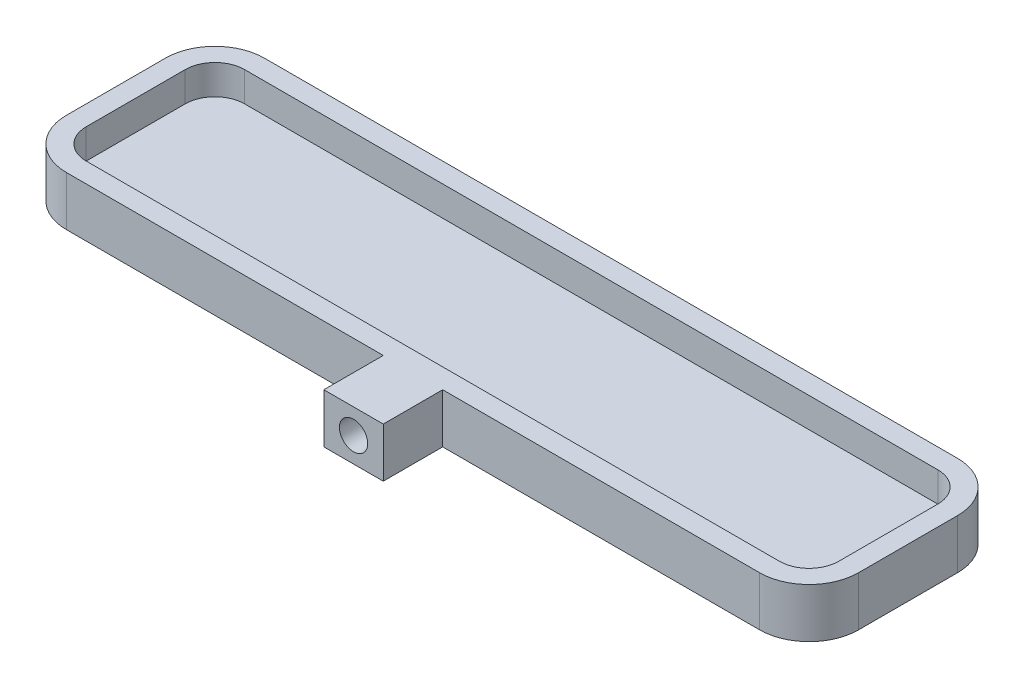
ISO-10303-21;
HEADER;
FILE_DESCRIPTION(('STEP AP214'),'2;1');
FILE_NAME('part.step','',(''),(''),'','','');
FILE_SCHEMA(('AUTOMOTIVE_DESIGN { 1 0 10303 214 1 1 1 1 }'));
ENDSEC;
DATA;
#1=APPLICATION_CONTEXT('core data for automotive mechanical design processes');
#2=APPLICATION_PROTOCOL_DEFINITION('international standard','automotive_design',2000,#1);
#3=PRODUCT_CONTEXT('',#1,'mechanical');
#4=PRODUCT('Part','Part','',(#3));
#5=PRODUCT_RELATED_PRODUCT_CATEGORY('part','',(#4));
#6=PRODUCT_DEFINITION_FORMATION('','',#4);
#7=PRODUCT_DEFINITION_CONTEXT('part definition',#1,'design');
#8=PRODUCT_DEFINITION('design','',#6,#7);
#9=PRODUCT_DEFINITION_SHAPE('','',#8);
#10=(LENGTH_UNIT() NAMED_UNIT(*) SI_UNIT(.MILLI.,.METRE.));
#11=(NAMED_UNIT(*) PLANE_ANGLE_UNIT() SI_UNIT($,.RADIAN.));
#12=(NAMED_UNIT(*) SI_UNIT($,.STERADIAN.) SOLID_ANGLE_UNIT());
#13=UNCERTAINTY_MEASURE_WITH_UNIT(LENGTH_MEASURE(1.E-05),#10,'distance_accuracy_value','');
#14=(GEOMETRIC_REPRESENTATION_CONTEXT(3) GLOBAL_UNCERTAINTY_ASSIGNED_CONTEXT((#13)) GLOBAL_UNIT_ASSIGNED_CONTEXT((#10,
#11,#12)) REPRESENTATION_CONTEXT('',''));
#15=CARTESIAN_POINT('',(0.,0.,0.));
#16=DIRECTION('',(0.,0.,1.));
#17=DIRECTION('',(1.,0.,0.));
#18=AXIS2_PLACEMENT_3D('',#15,#16,#17);
#19=CARTESIAN_POINT('',(-40.,5.,10.));
#20=DIRECTION('',(0.,0.,-1.));
#21=DIRECTION('',(-1.,0.,0.));
#22=AXIS2_PLACEMENT_3D('',#19,#20,#21);
#23=PLANE('',#22);
#24=DIRECTION('',(0.,1.,0.));
#25=VECTOR('',#24,1.);
#26=CARTESIAN_POINT('',(3.,5.,10.));
#27=LINE('',#26,#25);
#28=CARTESIAN_POINT('',(3.,0.,10.));
#29=VERTEX_POINT('',#28);
#30=CARTESIAN_POINT('',(3.,5.,10.));
#31=VERTEX_POINT('',#30);
#32=EDGE_CURVE('E198',#29,#31,#27,.T.);
#33=ORIENTED_EDGE('',*,*,#32,.F.);
#34=DIRECTION('',(1.,0.,0.));
#35=VECTOR('',#34,1.);
#36=CARTESIAN_POINT('',(-40.,0.,10.));
#37=LINE('',#36,#35);
#38=CARTESIAN_POINT('',(35.,0.,10.));
#39=VERTEX_POINT('',#38);
#40=EDGE_CURVE('E280',#29,#39,#37,.T.);
#41=ORIENTED_EDGE('',*,*,#40,.T.);
#42=DIRECTION('',(0.,-1.,0.));
#43=VECTOR('',#42,1.);
#44=CARTESIAN_POINT('',(35.,5.,10.));
#45=LINE('',#44,#43);
#46=CARTESIAN_POINT('',(35.,5.,10.));
#47=VERTEX_POINT('',#46);
#48=EDGE_CURVE('E317',#39,#47,#45,.F.);
#49=ORIENTED_EDGE('',*,*,#48,.T.);
#50=DIRECTION('',(1.,0.,0.));
#51=VECTOR('',#50,1.);
#52=CARTESIAN_POINT('',(-40.,5.,10.));
#53=LINE('',#52,#51);
#54=EDGE_CURVE('E52',#31,#47,#53,.T.);
#55=ORIENTED_EDGE('',*,*,#54,.F.);
#56=EDGE_LOOP('',(#33,#41,#49,#55));
#57=FACE_BOUND('',#56,.T.);
#58=ADVANCED_FACE('F37',(#57),#23,.F.);
#59=DIRECTION('',(0.,-1.,0.));
#60=VECTOR('',#59,1.);
#61=CARTESIAN_POINT('',(-3.,5.,10.));
#62=LINE('',#61,#60);
#63=CARTESIAN_POINT('',(-3.,5.,10.));
#64=VERTEX_POINT('',#63);
#65=CARTESIAN_POINT('',(-3.,0.,10.));
#66=VERTEX_POINT('',#65);
#67=EDGE_CURVE('E60',#64,#66,#62,.T.);
#68=ORIENTED_EDGE('',*,*,#67,.F.);
#69=CARTESIAN_POINT('',(-35.,5.,10.));
#70=VERTEX_POINT('',#69);
#71=EDGE_CURVE('E269',#70,#64,#53,.T.);
#72=ORIENTED_EDGE('',*,*,#71,.F.);
#73=DIRECTION('',(0.,-1.,0.));
#74=VECTOR('',#73,1.);
#75=CARTESIAN_POINT('',(-35.,5.,10.));
#76=LINE('',#75,#74);
#77=CARTESIAN_POINT('',(-35.,0.,10.));
#78=VERTEX_POINT('',#77);
#79=EDGE_CURVE('E314',#70,#78,#76,.T.);
#80=ORIENTED_EDGE('',*,*,#79,.T.);
#81=EDGE_CURVE('E281',#78,#66,#37,.T.);
#82=ORIENTED_EDGE('',*,*,#81,.T.);
#83=EDGE_LOOP('',(#68,#72,#80,#82));
#84=FACE_BOUND('',#83,.T.);
#85=ADVANCED_FACE('F336',(#84),#23,.F.);
#86=CARTESIAN_POINT('',(0.,5.,0.));
#87=DIRECTION('',(0.,1.,0.));
#88=DIRECTION('',(0.,0.,1.));
#89=AXIS2_PLACEMENT_3D('',#86,#87,#88);
#90=PLANE('',#89);
#91=DIRECTION('',(0.,0.,1.));
#92=VECTOR('',#91,1.);
#93=CARTESIAN_POINT('',(40.,5.,-10.));
#94=LINE('',#93,#92);
#95=CARTESIAN_POINT('',(40.,5.,-5.));
#96=VERTEX_POINT('',#95);
#97=CARTESIAN_POINT('',(40.,5.,5.));
#98=VERTEX_POINT('',#97);
#99=EDGE_CURVE('E271',#96,#98,#94,.T.);
#100=ORIENTED_EDGE('',*,*,#99,.F.);
#101=CARTESIAN_POINT('',(35.,5.,-5.));
#102=DIRECTION('',(0.,1.,0.));
#103=DIRECTION('',(0.,0.,1.));
#104=AXIS2_PLACEMENT_3D('',#101,#102,#103);
#105=CIRCLE('',#104,5.);
#106=CARTESIAN_POINT('',(35.,5.,-10.));
#107=VERTEX_POINT('',#106);
#108=EDGE_CURVE('E312',#96,#107,#105,.T.);
#109=ORIENTED_EDGE('',*,*,#108,.T.);
#110=DIRECTION('',(1.,0.,0.));
#111=VECTOR('',#110,1.);
#112=CARTESIAN_POINT('',(-40.,5.,-10.));
#113=LINE('',#112,#111);
#114=CARTESIAN_POINT('',(-35.,5.,-10.));
#115=VERTEX_POINT('',#114);
#116=EDGE_CURVE('E274',#115,#107,#113,.T.);
#117=ORIENTED_EDGE('',*,*,#116,.F.);
#118=CARTESIAN_POINT('',(-35.,5.,-5.));
#119=DIRECTION('',(0.,1.,0.));
#120=DIRECTION('',(0.,0.,1.));
#121=AXIS2_PLACEMENT_3D('',#118,#119,#120);
#122=CIRCLE('',#121,5.);
#123=CARTESIAN_POINT('',(-40.,5.,-5.));
#124=VERTEX_POINT('',#123);
#125=EDGE_CURVE('E306',#115,#124,#122,.T.);
#126=ORIENTED_EDGE('',*,*,#125,.T.);
#127=DIRECTION('',(0.,0.,1.));
#128=VECTOR('',#127,1.);
#129=CARTESIAN_POINT('',(-40.,5.,-10.));
#130=LINE('',#129,#128);
#131=CARTESIAN_POINT('',(-40.,5.,5.));
#132=VERTEX_POINT('',#131);
#133=EDGE_CURVE('E265',#124,#132,#130,.T.);
#134=ORIENTED_EDGE('',*,*,#133,.T.);
#135=CARTESIAN_POINT('',(-35.,5.,5.));
#136=DIRECTION('',(0.,1.,0.));
#137=DIRECTION('',(0.,0.,1.));
#138=AXIS2_PLACEMENT_3D('',#135,#136,#137);
#139=CIRCLE('',#138,5.);
#140=EDGE_CURVE('E308',#132,#70,#139,.T.);
#141=ORIENTED_EDGE('',*,*,#140,.T.);
#142=ORIENTED_EDGE('',*,*,#71,.T.);
#143=DIRECTION('',(0.,0.,-1.));
#144=VECTOR('',#143,1.);
#145=CARTESIAN_POINT('',(-3.,5.,16.));
#146=LINE('',#145,#144);
#147=CARTESIAN_POINT('',(-3.,5.,16.));
#148=VERTEX_POINT('',#147);
#149=EDGE_CURVE('E183',#148,#64,#146,.T.);
#150=ORIENTED_EDGE('',*,*,#149,.F.);
#151=DIRECTION('',(-1.,0.,0.));
#152=VECTOR('',#151,1.);
#153=CARTESIAN_POINT('',(-3.,5.,16.));
#154=LINE('',#153,#152);
#155=CARTESIAN_POINT('',(3.,5.,16.));
#156=VERTEX_POINT('',#155);
#157=EDGE_CURVE('E174',#156,#148,#154,.T.);
#158=ORIENTED_EDGE('',*,*,#157,.F.);
#159=DIRECTION('',(0.,0.,-1.));
#160=VECTOR('',#159,1.);
#161=CARTESIAN_POINT('',(3.,5.,16.));
#162=LINE('',#161,#160);
#163=EDGE_CURVE('E180',#156,#31,#162,.T.);
#164=ORIENTED_EDGE('',*,*,#163,.T.);
#165=ORIENTED_EDGE('',*,*,#54,.T.);
#166=CARTESIAN_POINT('',(35.,5.,5.));
#167=DIRECTION('',(0.,1.,0.));
#168=DIRECTION('',(0.,0.,1.));
#169=AXIS2_PLACEMENT_3D('',#166,#167,#168);
#170=CIRCLE('',#169,5.);
#171=EDGE_CURVE('E310',#47,#98,#170,.T.);
#172=ORIENTED_EDGE('',*,*,#171,.T.);
#173=EDGE_LOOP('',(#100,#109,#117,#126,#134,#141,#142,#150,#158,#164,#165,#172));
#174=FACE_BOUND('',#173,.T.);
#175=CARTESIAN_POINT('',(35.,5.,-5.));
#176=DIRECTION('',(0.,1.,0.));
#177=DIRECTION('',(0.,0.,1.));
#178=AXIS2_PLACEMENT_3D('',#175,#176,#177);
#179=CIRCLE('',#178,3.);
#180=CARTESIAN_POINT('',(38.,5.,-5.));
#181=VERTEX_POINT('',#180);
#182=CARTESIAN_POINT('',(35.,5.,-8.));
#183=VERTEX_POINT('',#182);
#184=EDGE_CURVE('E239',#181,#183,#179,.T.);
#185=ORIENTED_EDGE('',*,*,#184,.F.);
#186=DIRECTION('',(0.,0.,1.));
#187=VECTOR('',#186,1.);
#188=CARTESIAN_POINT('',(38.,5.,-10.));
#189=LINE('',#188,#187);
#190=CARTESIAN_POINT('',(38.,5.,5.));
#191=VERTEX_POINT('',#190);
#192=EDGE_CURVE('E257',#181,#191,#189,.T.);
#193=ORIENTED_EDGE('',*,*,#192,.T.);
#194=CARTESIAN_POINT('',(35.,5.,5.));
#195=DIRECTION('',(0.,1.,0.));
#196=DIRECTION('',(0.,0.,1.));
#197=AXIS2_PLACEMENT_3D('',#194,#195,#196);
#198=CIRCLE('',#197,3.);
#199=CARTESIAN_POINT('',(35.,5.,8.));
#200=VERTEX_POINT('',#199);
#201=EDGE_CURVE('E255',#200,#191,#198,.T.);
#202=ORIENTED_EDGE('',*,*,#201,.F.);
#203=DIRECTION('',(1.,0.,0.));
#204=VECTOR('',#203,1.);
#205=CARTESIAN_POINT('',(-40.,5.,8.));
#206=LINE('',#205,#204);
#207=CARTESIAN_POINT('',(-35.,5.,8.));
#208=VERTEX_POINT('',#207);
#209=EDGE_CURVE('E252',#208,#200,#206,.T.);
#210=ORIENTED_EDGE('',*,*,#209,.F.);
#211=CARTESIAN_POINT('',(-35.,5.,5.));
#212=DIRECTION('',(0.,1.,0.));
#213=DIRECTION('',(0.,0.,1.));
#214=AXIS2_PLACEMENT_3D('',#211,#212,#213);
#215=CIRCLE('',#214,3.);
#216=CARTESIAN_POINT('',(-38.,5.,5.));
#217=VERTEX_POINT('',#216);
#218=EDGE_CURVE('E253',#217,#208,#215,.T.);
#219=ORIENTED_EDGE('',*,*,#218,.F.);
#220=DIRECTION('',(0.,0.,1.));
#221=VECTOR('',#220,1.);
#222=CARTESIAN_POINT('',(-38.,5.,-10.));
#223=LINE('',#222,#221);
#224=CARTESIAN_POINT('',(-38.,5.,-5.));
#225=VERTEX_POINT('',#224);
#226=EDGE_CURVE('E218',#225,#217,#223,.T.);
#227=ORIENTED_EDGE('',*,*,#226,.F.);
#228=CARTESIAN_POINT('',(-35.,5.,-5.));
#229=DIRECTION('',(0.,1.,0.));
#230=DIRECTION('',(0.,0.,1.));
#231=AXIS2_PLACEMENT_3D('',#228,#229,#230);
#232=CIRCLE('',#231,3.);
#233=CARTESIAN_POINT('',(-35.,5.,-8.));
#234=VERTEX_POINT('',#233);
#235=EDGE_CURVE('E244',#234,#225,#232,.T.);
#236=ORIENTED_EDGE('',*,*,#235,.F.);
#237=DIRECTION('',(1.,0.,0.));
#238=VECTOR('',#237,1.);
#239=CARTESIAN_POINT('',(-40.,5.,-8.));
#240=LINE('',#239,#238);
#241=EDGE_CURVE('E249',#234,#183,#240,.T.);
#242=ORIENTED_EDGE('',*,*,#241,.T.);
#243=EDGE_LOOP('',(#185,#193,#202,#210,#219,#227,#236,#242));
#244=FACE_BOUND('',#243,.T.);
#245=ADVANCED_FACE('F177',(#174,#244),#90,.T.);
#246=CARTESIAN_POINT('',(-40.,5.,-10.));
#247=DIRECTION('',(1.,0.,0.));
#248=DIRECTION('',(0.,0.,-1.));
#249=AXIS2_PLACEMENT_3D('',#246,#247,#248);
#250=PLANE('',#249);
#251=DIRECTION('',(0.,0.,1.));
#252=VECTOR('',#251,1.);
#253=CARTESIAN_POINT('',(-40.,0.,-10.));
#254=LINE('',#253,#252);
#255=CARTESIAN_POINT('',(-40.,0.,-5.));
#256=VERTEX_POINT('',#255);
#257=CARTESIAN_POINT('',(-40.,0.,5.));
#258=VERTEX_POINT('',#257);
#259=EDGE_CURVE('E210',#256,#258,#254,.T.);
#260=ORIENTED_EDGE('',*,*,#259,.T.);
#261=DIRECTION('',(0.,-1.,0.));
#262=VECTOR('',#261,1.);
#263=CARTESIAN_POINT('',(-40.,5.,5.));
#264=LINE('',#263,#262);
#265=EDGE_CURVE('E11',#258,#132,#264,.F.);
#266=ORIENTED_EDGE('',*,*,#265,.T.);
#267=ORIENTED_EDGE('',*,*,#133,.F.);
#268=DIRECTION('',(0.,-1.,0.));
#269=VECTOR('',#268,1.);
#270=CARTESIAN_POINT('',(-40.,0.,-5.));
#271=LINE('',#270,#269);
#272=EDGE_CURVE('E45',#124,#256,#271,.T.);
#273=ORIENTED_EDGE('',*,*,#272,.T.);
#274=EDGE_LOOP('',(#260,#266,#267,#273));
#275=FACE_BOUND('',#274,.T.);
#276=ADVANCED_FACE('F323',(#275),#250,.F.);
#277=CARTESIAN_POINT('',(40.,5.,-10.));
#278=DIRECTION('',(1.,0.,0.));
#279=DIRECTION('',(0.,0.,-1.));
#280=AXIS2_PLACEMENT_3D('',#277,#278,#279);
#281=PLANE('',#280);
#282=DIRECTION('',(0.,0.,1.));
#283=VECTOR('',#282,1.);
#284=CARTESIAN_POINT('',(40.,0.,-10.));
#285=LINE('',#284,#283);
#286=CARTESIAN_POINT('',(40.,0.,-5.));
#287=VERTEX_POINT('',#286);
#288=CARTESIAN_POINT('',(40.,0.,5.));
#289=VERTEX_POINT('',#288);
#290=EDGE_CURVE('E283',#287,#289,#285,.T.);
#291=ORIENTED_EDGE('',*,*,#290,.F.);
#292=DIRECTION('',(0.,-1.,0.));
#293=VECTOR('',#292,1.);
#294=CARTESIAN_POINT('',(40.,5.,-5.));
#295=LINE('',#294,#293);
#296=EDGE_CURVE('E304',#287,#96,#295,.F.);
#297=ORIENTED_EDGE('',*,*,#296,.T.);
#298=ORIENTED_EDGE('',*,*,#99,.T.);
#299=DIRECTION('',(0.,-1.,0.));
#300=VECTOR('',#299,1.);
#301=CARTESIAN_POINT('',(40.,0.,5.));
#302=LINE('',#301,#300);
#303=EDGE_CURVE('E301',#98,#289,#302,.T.);
#304=ORIENTED_EDGE('',*,*,#303,.T.);
#305=EDGE_LOOP('',(#291,#297,#298,#304));
#306=FACE_BOUND('',#305,.T.);
#307=ADVANCED_FACE('F355',(#306),#281,.T.);
#308=CARTESIAN_POINT('',(-40.,5.,-10.));
#309=DIRECTION('',(0.,0.,-1.));
#310=DIRECTION('',(-1.,0.,0.));
#311=AXIS2_PLACEMENT_3D('',#308,#309,#310);
#312=PLANE('',#311);
#313=ORIENTED_EDGE('',*,*,#116,.T.);
#314=DIRECTION('',(0.,-1.,0.));
#315=VECTOR('',#314,1.);
#316=CARTESIAN_POINT('',(35.,5.,-10.));
#317=LINE('',#316,#315);
#318=CARTESIAN_POINT('',(35.,0.,-10.));
#319=VERTEX_POINT('',#318);
#320=EDGE_CURVE('E289',#107,#319,#317,.T.);
#321=ORIENTED_EDGE('',*,*,#320,.T.);
#322=DIRECTION('',(1.,0.,0.));
#323=VECTOR('',#322,1.);
#324=CARTESIAN_POINT('',(-40.,0.,-10.));
#325=LINE('',#324,#323);
#326=CARTESIAN_POINT('',(-35.,0.,-10.));
#327=VERTEX_POINT('',#326);
#328=EDGE_CURVE('E268',#327,#319,#325,.T.);
#329=ORIENTED_EDGE('',*,*,#328,.F.);
#330=DIRECTION('',(0.,-1.,0.));
#331=VECTOR('',#330,1.);
#332=CARTESIAN_POINT('',(-35.,5.,-10.));
#333=LINE('',#332,#331);
#334=EDGE_CURVE('E277',#327,#115,#333,.F.);
#335=ORIENTED_EDGE('',*,*,#334,.T.);
#336=EDGE_LOOP('',(#313,#321,#329,#335));
#337=FACE_BOUND('',#336,.T.);
#338=ADVANCED_FACE('F382',(#337),#312,.T.);
#339=CARTESIAN_POINT('',(0.,0.,0.));
#340=DIRECTION('',(0.,1.,0.));
#341=DIRECTION('',(0.,0.,1.));
#342=AXIS2_PLACEMENT_3D('',#339,#340,#341);
#343=PLANE('',#342);
#344=ORIENTED_EDGE('',*,*,#328,.T.);
#345=CARTESIAN_POINT('',(35.,0.,-5.));
#346=DIRECTION('',(0.,1.,0.));
#347=DIRECTION('',(0.,0.,1.));
#348=AXIS2_PLACEMENT_3D('',#345,#346,#347);
#349=CIRCLE('',#348,5.);
#350=EDGE_CURVE('E299',#319,#287,#349,.F.);
#351=ORIENTED_EDGE('',*,*,#350,.T.);
#352=ORIENTED_EDGE('',*,*,#290,.T.);
#353=CARTESIAN_POINT('',(35.,0.,5.));
#354=DIRECTION('',(0.,1.,0.));
#355=DIRECTION('',(0.,0.,1.));
#356=AXIS2_PLACEMENT_3D('',#353,#354,#355);
#357=CIRCLE('',#356,5.);
#358=EDGE_CURVE('E296',#289,#39,#357,.F.);
#359=ORIENTED_EDGE('',*,*,#358,.T.);
#360=ORIENTED_EDGE('',*,*,#40,.F.);
#361=DIRECTION('',(0.,0.,-1.));
#362=VECTOR('',#361,1.);
#363=CARTESIAN_POINT('',(3.,0.,16.));
#364=LINE('',#363,#362);
#365=CARTESIAN_POINT('',(3.,0.,16.));
#366=VERTEX_POINT('',#365);
#367=EDGE_CURVE('E341',#366,#29,#364,.T.);
#368=ORIENTED_EDGE('',*,*,#367,.F.);
#369=DIRECTION('',(1.,0.,0.));
#370=VECTOR('',#369,1.);
#371=CARTESIAN_POINT('',(-3.,0.,16.));
#372=LINE('',#371,#370);
#373=CARTESIAN_POINT('',(-3.,0.,16.));
#374=VERTEX_POINT('',#373);
#375=EDGE_CURVE('E192',#374,#366,#372,.T.);
#376=ORIENTED_EDGE('',*,*,#375,.F.);
#377=DIRECTION('',(0.,0.,-1.));
#378=VECTOR('',#377,1.);
#379=CARTESIAN_POINT('',(-3.,0.,16.));
#380=LINE('',#379,#378);
#381=EDGE_CURVE('E204',#374,#66,#380,.T.);
#382=ORIENTED_EDGE('',*,*,#381,.T.);
#383=ORIENTED_EDGE('',*,*,#81,.F.);
#384=CARTESIAN_POINT('',(-35.,0.,5.));
#385=DIRECTION('',(0.,1.,0.));
#386=DIRECTION('',(0.,0.,1.));
#387=AXIS2_PLACEMENT_3D('',#384,#385,#386);
#388=CIRCLE('',#387,5.);
#389=EDGE_CURVE('E294',#78,#258,#388,.F.);
#390=ORIENTED_EDGE('',*,*,#389,.T.);
#391=ORIENTED_EDGE('',*,*,#259,.F.);
#392=CARTESIAN_POINT('',(-35.,0.,-5.));
#393=DIRECTION('',(0.,1.,0.));
#394=DIRECTION('',(0.,0.,1.));
#395=AXIS2_PLACEMENT_3D('',#392,#393,#394);
#396=CIRCLE('',#395,5.);
#397=EDGE_CURVE('E292',#256,#327,#396,.F.);
#398=ORIENTED_EDGE('',*,*,#397,.T.);
#399=EDGE_LOOP('',(#344,#351,#352,#359,#360,#368,#376,#382,#383,#390,#391,#398));
#400=FACE_BOUND('',#399,.T.);
#401=ADVANCED_FACE('F328',(#400),#343,.F.);
#402=CARTESIAN_POINT('',(35.,5.,-5.));
#403=DIRECTION('',(0.,-1.,0.));
#404=DIRECTION('',(0.,0.,-1.));
#405=AXIS2_PLACEMENT_3D('',#402,#403,#404);
#406=CYLINDRICAL_SURFACE('',#405,5.);
#407=ORIENTED_EDGE('',*,*,#108,.F.);
#408=ORIENTED_EDGE('',*,*,#296,.F.);
#409=ORIENTED_EDGE('',*,*,#350,.F.);
#410=ORIENTED_EDGE('',*,*,#320,.F.);
#411=EDGE_LOOP('',(#407,#408,#409,#410));
#412=FACE_BOUND('',#411,.T.);
#413=ADVANCED_FACE('F359',(#412),#406,.T.);
#414=CARTESIAN_POINT('',(35.,5.,5.));
#415=DIRECTION('',(0.,1.,0.));
#416=DIRECTION('',(0.,0.,1.));
#417=AXIS2_PLACEMENT_3D('',#414,#415,#416);
#418=CYLINDRICAL_SURFACE('',#417,5.);
#419=ORIENTED_EDGE('',*,*,#171,.F.);
#420=ORIENTED_EDGE('',*,*,#48,.F.);
#421=ORIENTED_EDGE('',*,*,#358,.F.);
#422=ORIENTED_EDGE('',*,*,#303,.F.);
#423=EDGE_LOOP('',(#419,#420,#421,#422));
#424=FACE_BOUND('',#423,.T.);
#425=ADVANCED_FACE('F362',(#424),#418,.T.);
#426=CARTESIAN_POINT('',(-35.,5.,5.));
#427=DIRECTION('',(0.,-1.,0.));
#428=DIRECTION('',(0.,0.,-1.));
#429=AXIS2_PLACEMENT_3D('',#426,#427,#428);
#430=CYLINDRICAL_SURFACE('',#429,5.);
#431=ORIENTED_EDGE('',*,*,#140,.F.);
#432=ORIENTED_EDGE('',*,*,#265,.F.);
#433=ORIENTED_EDGE('',*,*,#389,.F.);
#434=ORIENTED_EDGE('',*,*,#79,.F.);
#435=EDGE_LOOP('',(#431,#432,#433,#434));
#436=FACE_BOUND('',#435,.T.);
#437=ADVANCED_FACE('F335',(#436),#430,.T.);
#438=CARTESIAN_POINT('',(-35.,5.,-5.));
#439=DIRECTION('',(0.,1.,0.));
#440=DIRECTION('',(0.,0.,1.));
#441=AXIS2_PLACEMENT_3D('',#438,#439,#440);
#442=CYLINDRICAL_SURFACE('',#441,5.);
#443=ORIENTED_EDGE('',*,*,#125,.F.);
#444=ORIENTED_EDGE('',*,*,#334,.F.);
#445=ORIENTED_EDGE('',*,*,#397,.F.);
#446=ORIENTED_EDGE('',*,*,#272,.F.);
#447=EDGE_LOOP('',(#443,#444,#445,#446));
#448=FACE_BOUND('',#447,.T.);
#449=ADVANCED_FACE('F39',(#448),#442,.T.);
#450=CARTESIAN_POINT('',(-38.,5.,-10.));
#451=DIRECTION('',(1.,0.,0.));
#452=DIRECTION('',(0.,0.,-1.));
#453=AXIS2_PLACEMENT_3D('',#450,#451,#452);
#454=PLANE('',#453);
#455=DIRECTION('',(0.,0.,1.));
#456=VECTOR('',#455,1.);
#457=CARTESIAN_POINT('',(-38.,2.,-10.));
#458=LINE('',#457,#456);
#459=CARTESIAN_POINT('',(-38.,2.,-5.));
#460=VERTEX_POINT('',#459);
#461=CARTESIAN_POINT('',(-38.,2.,5.));
#462=VERTEX_POINT('',#461);
#463=EDGE_CURVE('E199',#460,#462,#458,.T.);
#464=ORIENTED_EDGE('',*,*,#463,.F.);
#465=DIRECTION('',(0.,1.,0.));
#466=VECTOR('',#465,1.);
#467=CARTESIAN_POINT('',(-38.,5.,-5.));
#468=LINE('',#467,#466);
#469=EDGE_CURVE('E211',#225,#460,#468,.F.);
#470=ORIENTED_EDGE('',*,*,#469,.F.);
#471=ORIENTED_EDGE('',*,*,#226,.T.);
#472=DIRECTION('',(0.,1.,0.));
#473=VECTOR('',#472,1.);
#474=CARTESIAN_POINT('',(-38.,5.,5.));
#475=LINE('',#474,#473);
#476=EDGE_CURVE('E208',#462,#217,#475,.T.);
#477=ORIENTED_EDGE('',*,*,#476,.F.);
#478=EDGE_LOOP('',(#464,#470,#471,#477));
#479=FACE_BOUND('',#478,.T.);
#480=ADVANCED_FACE('F370',(#479),#454,.T.);
#481=CARTESIAN_POINT('',(-40.,5.,8.));
#482=DIRECTION('',(0.,0.,-1.));
#483=DIRECTION('',(-1.,0.,0.));
#484=AXIS2_PLACEMENT_3D('',#481,#482,#483);
#485=PLANE('',#484);
#486=DIRECTION('',(1.,0.,0.));
#487=VECTOR('',#486,1.);
#488=CARTESIAN_POINT('',(-40.,2.,8.));
#489=LINE('',#488,#487);
#490=CARTESIAN_POINT('',(-35.,2.,8.));
#491=VERTEX_POINT('',#490);
#492=CARTESIAN_POINT('',(35.,2.,8.));
#493=VERTEX_POINT('',#492);
#494=EDGE_CURVE('E202',#491,#493,#489,.T.);
#495=ORIENTED_EDGE('',*,*,#494,.F.);
#496=DIRECTION('',(0.,1.,0.));
#497=VECTOR('',#496,1.);
#498=CARTESIAN_POINT('',(-35.,5.,8.));
#499=LINE('',#498,#497);
#500=EDGE_CURVE('E236',#208,#491,#499,.F.);
#501=ORIENTED_EDGE('',*,*,#500,.F.);
#502=ORIENTED_EDGE('',*,*,#209,.T.);
#503=DIRECTION('',(0.,1.,0.));
#504=VECTOR('',#503,1.);
#505=CARTESIAN_POINT('',(35.,5.,8.));
#506=LINE('',#505,#504);
#507=EDGE_CURVE('E214',#493,#200,#506,.T.);
#508=ORIENTED_EDGE('',*,*,#507,.F.);
#509=EDGE_LOOP('',(#495,#501,#502,#508));
#510=FACE_BOUND('',#509,.T.);
#511=ADVANCED_FACE('F374',(#510),#485,.T.);
#512=CARTESIAN_POINT('',(38.,5.,-10.));
#513=DIRECTION('',(1.,0.,0.));
#514=DIRECTION('',(0.,0.,-1.));
#515=AXIS2_PLACEMENT_3D('',#512,#513,#514);
#516=PLANE('',#515);
#517=DIRECTION('',(0.,0.,1.));
#518=VECTOR('',#517,1.);
#519=CARTESIAN_POINT('',(38.,2.,-10.));
#520=LINE('',#519,#518);
#521=CARTESIAN_POINT('',(38.,2.,-5.));
#522=VERTEX_POINT('',#521);
#523=CARTESIAN_POINT('',(38.,2.,5.));
#524=VERTEX_POINT('',#523);
#525=EDGE_CURVE('E219',#522,#524,#520,.T.);
#526=ORIENTED_EDGE('',*,*,#525,.T.);
#527=DIRECTION('',(0.,1.,0.));
#528=VECTOR('',#527,1.);
#529=CARTESIAN_POINT('',(38.,5.,5.));
#530=LINE('',#529,#528);
#531=EDGE_CURVE('E222',#191,#524,#530,.F.);
#532=ORIENTED_EDGE('',*,*,#531,.F.);
#533=ORIENTED_EDGE('',*,*,#192,.F.);
#534=DIRECTION('',(0.,1.,0.));
#535=VECTOR('',#534,1.);
#536=CARTESIAN_POINT('',(38.,5.,-5.));
#537=LINE('',#536,#535);
#538=EDGE_CURVE('E242',#522,#181,#537,.T.);
#539=ORIENTED_EDGE('',*,*,#538,.F.);
#540=EDGE_LOOP('',(#526,#532,#533,#539));
#541=FACE_BOUND('',#540,.T.);
#542=ADVANCED_FACE('F422',(#541),#516,.F.);
#543=CARTESIAN_POINT('',(-40.,5.,-8.));
#544=DIRECTION('',(0.,0.,-1.));
#545=DIRECTION('',(-1.,0.,0.));
#546=AXIS2_PLACEMENT_3D('',#543,#544,#545);
#547=PLANE('',#546);
#548=ORIENTED_EDGE('',*,*,#241,.F.);
#549=DIRECTION('',(0.,1.,0.));
#550=VECTOR('',#549,1.);
#551=CARTESIAN_POINT('',(-35.,5.,-8.));
#552=LINE('',#551,#550);
#553=CARTESIAN_POINT('',(-35.,2.,-8.));
#554=VERTEX_POINT('',#553);
#555=EDGE_CURVE('E247',#554,#234,#552,.T.);
#556=ORIENTED_EDGE('',*,*,#555,.F.);
#557=DIRECTION('',(1.,0.,0.));
#558=VECTOR('',#557,1.);
#559=CARTESIAN_POINT('',(-40.,2.,-8.));
#560=LINE('',#559,#558);
#561=CARTESIAN_POINT('',(35.,2.,-8.));
#562=VERTEX_POINT('',#561);
#563=EDGE_CURVE('E215',#554,#562,#560,.T.);
#564=ORIENTED_EDGE('',*,*,#563,.T.);
#565=DIRECTION('',(0.,1.,0.));
#566=VECTOR('',#565,1.);
#567=CARTESIAN_POINT('',(35.,5.,-8.));
#568=LINE('',#567,#566);
#569=EDGE_CURVE('E233',#183,#562,#568,.F.);
#570=ORIENTED_EDGE('',*,*,#569,.F.);
#571=EDGE_LOOP('',(#548,#556,#564,#570));
#572=FACE_BOUND('',#571,.T.);
#573=ADVANCED_FACE('F418',(#572),#547,.F.);
#574=CARTESIAN_POINT('',(0.,2.,0.));
#575=DIRECTION('',(0.,1.,0.));
#576=DIRECTION('',(0.,0.,1.));
#577=AXIS2_PLACEMENT_3D('',#574,#575,#576);
#578=PLANE('',#577);
#579=ORIENTED_EDGE('',*,*,#563,.F.);
#580=CARTESIAN_POINT('',(-35.,2.,-5.));
#581=DIRECTION('',(0.,1.,0.));
#582=DIRECTION('',(0.,0.,1.));
#583=AXIS2_PLACEMENT_3D('',#580,#581,#582);
#584=CIRCLE('',#583,3.);
#585=EDGE_CURVE('E231',#460,#554,#584,.F.);
#586=ORIENTED_EDGE('',*,*,#585,.F.);
#587=ORIENTED_EDGE('',*,*,#463,.T.);
#588=CARTESIAN_POINT('',(-35.,2.,5.));
#589=DIRECTION('',(0.,1.,0.));
#590=DIRECTION('',(0.,0.,1.));
#591=AXIS2_PLACEMENT_3D('',#588,#589,#590);
#592=CIRCLE('',#591,3.);
#593=EDGE_CURVE('E227',#491,#462,#592,.F.);
#594=ORIENTED_EDGE('',*,*,#593,.F.);
#595=ORIENTED_EDGE('',*,*,#494,.T.);
#596=CARTESIAN_POINT('',(35.,2.,5.));
#597=DIRECTION('',(0.,1.,0.));
#598=DIRECTION('',(0.,0.,1.));
#599=AXIS2_PLACEMENT_3D('',#596,#597,#598);
#600=CIRCLE('',#599,3.);
#601=EDGE_CURVE('E223',#524,#493,#600,.F.);
#602=ORIENTED_EDGE('',*,*,#601,.F.);
#603=ORIENTED_EDGE('',*,*,#525,.F.);
#604=CARTESIAN_POINT('',(35.,2.,-5.));
#605=DIRECTION('',(0.,1.,0.));
#606=DIRECTION('',(0.,0.,1.));
#607=AXIS2_PLACEMENT_3D('',#604,#605,#606);
#608=CIRCLE('',#607,3.);
#609=EDGE_CURVE('E220',#562,#522,#608,.F.);
#610=ORIENTED_EDGE('',*,*,#609,.F.);
#611=EDGE_LOOP('',(#579,#586,#587,#594,#595,#602,#603,#610));
#612=FACE_BOUND('',#611,.T.);
#613=ADVANCED_FACE('F414',(#612),#578,.T.);
#614=CARTESIAN_POINT('',(35.,5.,-5.));
#615=DIRECTION('',(0.,-1.,0.));
#616=DIRECTION('',(0.,0.,-1.));
#617=AXIS2_PLACEMENT_3D('',#614,#615,#616);
#618=CYLINDRICAL_SURFACE('',#617,3.);
#619=ORIENTED_EDGE('',*,*,#184,.T.);
#620=ORIENTED_EDGE('',*,*,#569,.T.);
#621=ORIENTED_EDGE('',*,*,#609,.T.);
#622=ORIENTED_EDGE('',*,*,#538,.T.);
#623=EDGE_LOOP('',(#619,#620,#621,#622));
#624=FACE_BOUND('',#623,.T.);
#625=ADVANCED_FACE('F410',(#624),#618,.F.);
#626=CARTESIAN_POINT('',(35.,5.,5.));
#627=DIRECTION('',(0.,1.,0.));
#628=DIRECTION('',(0.,0.,1.));
#629=AXIS2_PLACEMENT_3D('',#626,#627,#628);
#630=CYLINDRICAL_SURFACE('',#629,3.);
#631=ORIENTED_EDGE('',*,*,#201,.T.);
#632=ORIENTED_EDGE('',*,*,#531,.T.);
#633=ORIENTED_EDGE('',*,*,#601,.T.);
#634=ORIENTED_EDGE('',*,*,#507,.T.);
#635=EDGE_LOOP('',(#631,#632,#633,#634));
#636=FACE_BOUND('',#635,.T.);
#637=ADVANCED_FACE('F406',(#636),#630,.F.);
#638=CARTESIAN_POINT('',(-35.,5.,5.));
#639=DIRECTION('',(0.,-1.,0.));
#640=DIRECTION('',(0.,0.,-1.));
#641=AXIS2_PLACEMENT_3D('',#638,#639,#640);
#642=CYLINDRICAL_SURFACE('',#641,3.);
#643=ORIENTED_EDGE('',*,*,#218,.T.);
#644=ORIENTED_EDGE('',*,*,#500,.T.);
#645=ORIENTED_EDGE('',*,*,#593,.T.);
#646=ORIENTED_EDGE('',*,*,#476,.T.);
#647=EDGE_LOOP('',(#643,#644,#645,#646));
#648=FACE_BOUND('',#647,.T.);
#649=ADVANCED_FACE('F402',(#648),#642,.F.);
#650=CARTESIAN_POINT('',(-35.,5.,-5.));
#651=DIRECTION('',(0.,1.,0.));
#652=DIRECTION('',(0.,0.,1.));
#653=AXIS2_PLACEMENT_3D('',#650,#651,#652);
#654=CYLINDRICAL_SURFACE('',#653,3.);
#655=ORIENTED_EDGE('',*,*,#235,.T.);
#656=ORIENTED_EDGE('',*,*,#469,.T.);
#657=ORIENTED_EDGE('',*,*,#585,.T.);
#658=ORIENTED_EDGE('',*,*,#555,.T.);
#659=EDGE_LOOP('',(#655,#656,#657,#658));
#660=FACE_BOUND('',#659,.T.);
#661=ADVANCED_FACE('F399',(#660),#654,.F.);
#662=CARTESIAN_POINT('',(3.,5.,16.));
#663=DIRECTION('',(-1.,0.,0.));
#664=DIRECTION('',(0.,-1.,0.));
#665=AXIS2_PLACEMENT_3D('',#662,#663,#664);
#666=PLANE('',#665);
#667=ORIENTED_EDGE('',*,*,#32,.T.);
#668=ORIENTED_EDGE('',*,*,#163,.F.);
#669=DIRECTION('',(0.,1.,0.));
#670=VECTOR('',#669,1.);
#671=CARTESIAN_POINT('',(3.,5.,16.));
#672=LINE('',#671,#670);
#673=EDGE_CURVE('E187',#366,#156,#672,.T.);
#674=ORIENTED_EDGE('',*,*,#673,.F.);
#675=ORIENTED_EDGE('',*,*,#367,.T.);
#676=EDGE_LOOP('',(#667,#668,#674,#675));
#677=FACE_BOUND('',#676,.T.);
#678=ADVANCED_FACE('F197',(#677),#666,.F.);
#679=CARTESIAN_POINT('',(-3.,5.,16.));
#680=DIRECTION('',(1.,0.,0.));
#681=DIRECTION('',(0.,1.,0.));
#682=AXIS2_PLACEMENT_3D('',#679,#680,#681);
#683=PLANE('',#682);
#684=ORIENTED_EDGE('',*,*,#67,.T.);
#685=ORIENTED_EDGE('',*,*,#381,.F.);
#686=DIRECTION('',(0.,-1.,0.));
#687=VECTOR('',#686,1.);
#688=CARTESIAN_POINT('',(-3.,5.,16.));
#689=LINE('',#688,#687);
#690=EDGE_CURVE('E186',#148,#374,#689,.T.);
#691=ORIENTED_EDGE('',*,*,#690,.F.);
#692=ORIENTED_EDGE('',*,*,#149,.T.);
#693=EDGE_LOOP('',(#684,#685,#691,#692));
#694=FACE_BOUND('',#693,.T.);
#695=ADVANCED_FACE('F338',(#694),#683,.F.);
#696=CARTESIAN_POINT('',(0.,0.,16.));
#697=DIRECTION('',(0.,0.,1.));
#698=DIRECTION('',(1.,0.,0.));
#699=AXIS2_PLACEMENT_3D('',#696,#697,#698);
#700=PLANE('',#699);
#701=CARTESIAN_POINT('',(0.,2.5,16.));
#702=DIRECTION('',(0.,0.,1.));
#703=DIRECTION('',(1.,0.,0.));
#704=AXIS2_PLACEMENT_3D('',#701,#702,#703);
#705=CIRCLE('',#704,1.425);
#706=CARTESIAN_POINT('',(1.425,2.5,16.));
#707=VERTEX_POINT('',#706);
#708=EDGE_CURVE('E448',#707,#707,#705,.T.);
#709=ORIENTED_EDGE('',*,*,#708,.F.);
#710=EDGE_LOOP('',(#709));
#711=FACE_BOUND('',#710,.T.);
#712=ORIENTED_EDGE('',*,*,#673,.T.);
#713=ORIENTED_EDGE('',*,*,#157,.T.);
#714=ORIENTED_EDGE('',*,*,#690,.T.);
#715=ORIENTED_EDGE('',*,*,#375,.T.);
#716=EDGE_LOOP('',(#712,#713,#714,#715));
#717=FACE_BOUND('',#716,.T.);
#718=ADVANCED_FACE('F190',(#711,#717),#700,.T.);
#719=CARTESIAN_POINT('',(0.,2.5,12.));
#720=DIRECTION('',(0.,0.,1.));
#721=DIRECTION('',(1.,0.,0.));
#722=AXIS2_PLACEMENT_3D('',#719,#720,#721);
#723=CYLINDRICAL_SURFACE('',#722,1.425);
#724=CARTESIAN_POINT('',(0.,2.5,12.));
#725=DIRECTION('',(0.,0.,1.));
#726=DIRECTION('',(1.,0.,0.));
#727=AXIS2_PLACEMENT_3D('',#724,#725,#726);
#728=CIRCLE('',#727,1.425);
#729=CARTESIAN_POINT('',(1.425,2.5,12.));
#730=VERTEX_POINT('',#729);
#731=EDGE_CURVE('E345',#730,#730,#728,.T.);
#732=ORIENTED_EDGE('',*,*,#731,.F.);
#733=EDGE_LOOP('',(#732));
#734=FACE_BOUND('',#733,.T.);
#735=ORIENTED_EDGE('',*,*,#708,.T.);
#736=EDGE_LOOP('',(#735));
#737=FACE_BOUND('',#736,.T.);
#738=ADVANCED_FACE('F436',(#734,#737),#723,.F.);
#739=CARTESIAN_POINT('',(0.,2.5,12.));
#740=DIRECTION('',(0.,0.,1.));
#741=DIRECTION('',(1.,0.,0.));
#742=AXIS2_PLACEMENT_3D('',#739,#740,#741);
#743=PLANE('',#742);
#744=ORIENTED_EDGE('',*,*,#731,.T.);
#745=EDGE_LOOP('',(#744));
#746=FACE_BOUND('',#745,.T.);
#747=ADVANCED_FACE('F440',(#746),#743,.T.);
#748=CLOSED_SHELL('',(#58,#85,#245,#276,#307,#338,#401,#413,#425,#437,#449,#480,#511,#542,#573,
#613,#625,#637,#649,#661,#678,#695,#718,#738,#747));
#749=MANIFOLD_SOLID_BREP('B2',#748);
#750=ADVANCED_BREP_SHAPE_REPRESENTATION('',(#18,#749),#14);
#751=SHAPE_DEFINITION_REPRESENTATION(#9,#750);
ENDSEC;
END-ISO-10303-21;
